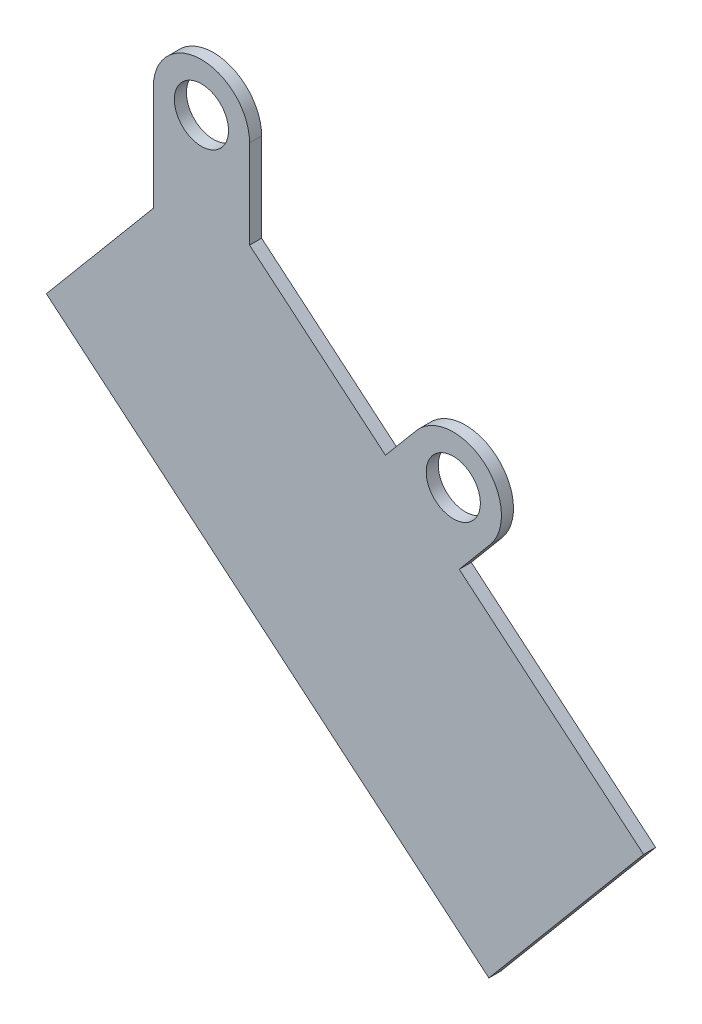
ISO-10303-21;
HEADER;
FILE_DESCRIPTION(('STEP AP214'),'2;1');
FILE_NAME('part.step','',(''),(''),'','','');
FILE_SCHEMA(('AUTOMOTIVE_DESIGN { 1 0 10303 214 1 1 1 1 }'));
ENDSEC;
DATA;
#1=APPLICATION_CONTEXT('core data for automotive mechanical design processes');
#2=APPLICATION_PROTOCOL_DEFINITION('international standard','automotive_design',2000,#1);
#3=PRODUCT_CONTEXT('',#1,'mechanical');
#4=PRODUCT('Part','Part','',(#3));
#5=PRODUCT_RELATED_PRODUCT_CATEGORY('part','',(#4));
#6=PRODUCT_DEFINITION_FORMATION('','',#4);
#7=PRODUCT_DEFINITION_CONTEXT('part definition',#1,'design');
#8=PRODUCT_DEFINITION('design','',#6,#7);
#9=PRODUCT_DEFINITION_SHAPE('','',#8);
#10=(LENGTH_UNIT() NAMED_UNIT(*) SI_UNIT(.MILLI.,.METRE.));
#11=(NAMED_UNIT(*) PLANE_ANGLE_UNIT() SI_UNIT($,.RADIAN.));
#12=(NAMED_UNIT(*) SI_UNIT($,.STERADIAN.) SOLID_ANGLE_UNIT());
#13=UNCERTAINTY_MEASURE_WITH_UNIT(LENGTH_MEASURE(1.E-05),#10,'distance_accuracy_value','');
#14=(GEOMETRIC_REPRESENTATION_CONTEXT(3) GLOBAL_UNCERTAINTY_ASSIGNED_CONTEXT((#13)) GLOBAL_UNIT_ASSIGNED_CONTEXT((#10,
#11,#12)) REPRESENTATION_CONTEXT('',''));
#15=CARTESIAN_POINT('',(0.,0.,0.));
#16=DIRECTION('',(0.,0.,1.));
#17=DIRECTION('',(1.,0.,0.));
#18=AXIS2_PLACEMENT_3D('',#15,#16,#17);
#19=CARTESIAN_POINT('',(158.284821825003,251.853740166621,3.175));
#20=DIRECTION('',(0.,0.,-1.));
#21=DIRECTION('',(-1.,0.,0.));
#22=AXIS2_PLACEMENT_3D('',#19,#20,#21);
#23=CYLINDRICAL_SURFACE('',#22,25.4);
#24=CARTESIAN_POINT('',(158.284821825003,251.853740166621,-3.175));
#25=DIRECTION('',(0.,0.,1.));
#26=DIRECTION('',(1.,0.,0.));
#27=AXIS2_PLACEMENT_3D('',#24,#25,#26);
#28=CIRCLE('',#27,25.4);
#29=CARTESIAN_POINT('',(138.827292969781,268.180545452659,-3.175));
#30=VERTEX_POINT('',#29);
#31=CARTESIAN_POINT('',(177.742350680225,235.526934880583,-3.175));
#32=VERTEX_POINT('',#31);
#33=EDGE_CURVE('E173',#30,#32,#28,.F.);
#34=ORIENTED_EDGE('',*,*,#33,.F.);
#35=DIRECTION('',(0.,0.,-1.));
#36=VECTOR('',#35,1.);
#37=CARTESIAN_POINT('',(138.827292969781,268.180545452659,3.175));
#38=LINE('',#37,#36);
#39=CARTESIAN_POINT('',(138.827292969781,268.180545452659,3.175));
#40=VERTEX_POINT('',#39);
#41=EDGE_CURVE('E11',#40,#30,#38,.T.);
#42=ORIENTED_EDGE('',*,*,#41,.F.);
#43=CARTESIAN_POINT('',(158.284821825003,251.853740166621,3.175));
#44=DIRECTION('',(0.,0.,1.));
#45=DIRECTION('',(1.,0.,0.));
#46=AXIS2_PLACEMENT_3D('',#43,#44,#45);
#47=CIRCLE('',#46,25.4);
#48=CARTESIAN_POINT('',(177.742350680225,235.526934880583,3.175));
#49=VERTEX_POINT('',#48);
#50=EDGE_CURVE('E217',#40,#49,#47,.F.);
#51=ORIENTED_EDGE('',*,*,#50,.T.);
#52=DIRECTION('',(0.,0.,-1.));
#53=VECTOR('',#52,1.);
#54=CARTESIAN_POINT('',(177.742350680225,235.526934880583,3.175));
#55=LINE('',#54,#53);
#56=EDGE_CURVE('E64',#49,#32,#55,.T.);
#57=ORIENTED_EDGE('',*,*,#56,.T.);
#58=EDGE_LOOP('',(#34,#42,#51,#57));
#59=FACE_BOUND('',#58,.T.);
#60=ADVANCED_FACE('F47',(#59),#23,.T.);
#61=CARTESIAN_POINT('',(-50.5859404822026,42.4466440013721,3.175));
#62=DIRECTION('',(0.766044443118977,-0.64278760968654,0.));
#63=DIRECTION('',(0.642787609686541,0.766044443118977,0.));
#64=AXIS2_PLACEMENT_3D('',#61,#62,#63);
#65=PLANE('',#64);
#66=DIRECTION('',(-0.642787609686541,-0.766044443118977,0.));
#67=VECTOR('',#66,1.);
#68=CARTESIAN_POINT('',(-50.5859404822026,42.4466440013721,-3.175));
#69=LINE('',#68,#67);
#70=CARTESIAN_POINT('',(122.500487683743,248.723016597437,-3.175));
#71=VERTEX_POINT('',#70);
#72=EDGE_CURVE('E176',#30,#71,#69,.T.);
#73=ORIENTED_EDGE('',*,*,#72,.T.);
#74=DIRECTION('',(0.,0.,-1.));
#75=VECTOR('',#74,1.);
#76=CARTESIAN_POINT('',(122.500487683743,248.723016597437,3.175));
#77=LINE('',#76,#75);
#78=CARTESIAN_POINT('',(122.500487683743,248.723016597437,3.175));
#79=VERTEX_POINT('',#78);
#80=EDGE_CURVE('E56',#79,#71,#77,.T.);
#81=ORIENTED_EDGE('',*,*,#80,.F.);
#82=DIRECTION('',(-0.642787609686541,-0.766044443118977,0.));
#83=VECTOR('',#82,1.);
#84=CARTESIAN_POINT('',(-50.5859404822026,42.4466440013721,3.175));
#85=LINE('',#84,#83);
#86=EDGE_CURVE('E271',#40,#79,#85,.T.);
#87=ORIENTED_EDGE('',*,*,#86,.F.);
#88=ORIENTED_EDGE('',*,*,#41,.T.);
#89=EDGE_LOOP('',(#73,#81,#87,#88));
#90=FACE_BOUND('',#89,.T.);
#91=ADVANCED_FACE('F305',(#90),#65,.F.);
#92=CARTESIAN_POINT('',(173.086428165946,206.276372596065,3.175));
#93=DIRECTION('',(-0.64278760968654,-0.766044443118977,0.));
#94=DIRECTION('',(0.766044443118978,-0.64278760968654,0.));
#95=AXIS2_PLACEMENT_3D('',#92,#93,#94);
#96=PLANE('',#95);
#97=DIRECTION('',(-0.766044443118977,0.64278760968654,0.));
#98=VECTOR('',#97,1.);
#99=CARTESIAN_POINT('',(173.086428165946,206.276372596065,-3.175));
#100=LINE('',#99,#98);
#101=CARTESIAN_POINT('',(50.8,308.886869368097,-3.175));
#102=VERTEX_POINT('',#101);
#103=EDGE_CURVE('E179',#71,#102,#100,.T.);
#104=ORIENTED_EDGE('',*,*,#103,.T.);
#105=DIRECTION('',(0.,0.,-1.));
#106=VECTOR('',#105,1.);
#107=CARTESIAN_POINT('',(50.8,308.886869368097,3.175));
#108=LINE('',#107,#106);
#109=CARTESIAN_POINT('',(50.8,308.886869368097,3.175));
#110=VERTEX_POINT('',#109);
#111=EDGE_CURVE('E238',#110,#102,#108,.T.);
#112=ORIENTED_EDGE('',*,*,#111,.F.);
#113=DIRECTION('',(-0.766044443118977,0.64278760968654,0.));
#114=VECTOR('',#113,1.);
#115=CARTESIAN_POINT('',(173.086428165946,206.276372596065,3.175));
#116=LINE('',#115,#114);
#117=EDGE_CURVE('E248',#79,#110,#116,.T.);
#118=ORIENTED_EDGE('',*,*,#117,.F.);
#119=ORIENTED_EDGE('',*,*,#80,.T.);
#120=EDGE_LOOP('',(#104,#112,#118,#119));
#121=FACE_BOUND('',#120,.T.);
#122=ADVANCED_FACE('F246',(#121),#96,.F.);
#123=CARTESIAN_POINT('',(50.8000000000001,0.,3.175));
#124=DIRECTION('',(1.,0.,0.));
#125=DIRECTION('',(0.,1.,0.));
#126=AXIS2_PLACEMENT_3D('',#123,#124,#125);
#127=PLANE('',#126);
#128=DIRECTION('',(0.,-1.,0.));
#129=VECTOR('',#128,1.);
#130=CARTESIAN_POINT('',(50.8000000000001,0.,-3.175));
#131=LINE('',#130,#129);
#132=CARTESIAN_POINT('',(50.8,355.6,-3.175));
#133=VERTEX_POINT('',#132);
#134=EDGE_CURVE('E183',#133,#102,#131,.T.);
#135=ORIENTED_EDGE('',*,*,#134,.F.);
#136=DIRECTION('',(0.,0.,-1.));
#137=VECTOR('',#136,1.);
#138=CARTESIAN_POINT('',(50.8,355.6,3.175));
#139=LINE('',#138,#137);
#140=CARTESIAN_POINT('',(50.8,355.6,3.175));
#141=VERTEX_POINT('',#140);
#142=EDGE_CURVE('E235',#141,#133,#139,.T.);
#143=ORIENTED_EDGE('',*,*,#142,.F.);
#144=DIRECTION('',(0.,-1.,0.));
#145=VECTOR('',#144,1.);
#146=CARTESIAN_POINT('',(50.8000000000001,0.,3.175));
#147=LINE('',#146,#145);
#148=EDGE_CURVE('E261',#141,#110,#147,.T.);
#149=ORIENTED_EDGE('',*,*,#148,.T.);
#150=ORIENTED_EDGE('',*,*,#111,.T.);
#151=EDGE_LOOP('',(#135,#143,#149,#150));
#152=FACE_BOUND('',#151,.T.);
#153=ADVANCED_FACE('F258',(#152),#127,.T.);
#154=CARTESIAN_POINT('',(25.3999999999999,355.6,3.175));
#155=DIRECTION('',(0.,0.,-1.));
#156=DIRECTION('',(-1.,0.,0.));
#157=AXIS2_PLACEMENT_3D('',#154,#155,#156);
#158=CYLINDRICAL_SURFACE('',#157,25.4);
#159=CARTESIAN_POINT('',(25.3999999999999,355.6,-3.175));
#160=DIRECTION('',(0.,0.,1.));
#161=DIRECTION('',(1.,0.,0.));
#162=AXIS2_PLACEMENT_3D('',#159,#160,#161);
#163=CIRCLE('',#162,25.4);
#164=CARTESIAN_POINT('',(0.,355.6,-3.175));
#165=VERTEX_POINT('',#164);
#166=EDGE_CURVE('E187',#165,#133,#163,.F.);
#167=ORIENTED_EDGE('',*,*,#166,.F.);
#168=DIRECTION('',(0.,0.,-1.));
#169=VECTOR('',#168,1.);
#170=CARTESIAN_POINT('',(0.,355.6,3.175));
#171=LINE('',#170,#169);
#172=CARTESIAN_POINT('',(0.,355.6,3.175));
#173=VERTEX_POINT('',#172);
#174=EDGE_CURVE('E232',#173,#165,#171,.T.);
#175=ORIENTED_EDGE('',*,*,#174,.F.);
#176=CARTESIAN_POINT('',(25.3999999999999,355.6,3.175));
#177=DIRECTION('',(0.,0.,1.));
#178=DIRECTION('',(1.,0.,0.));
#179=AXIS2_PLACEMENT_3D('',#176,#177,#178);
#180=CIRCLE('',#179,25.4);
#181=EDGE_CURVE('E265',#173,#141,#180,.F.);
#182=ORIENTED_EDGE('',*,*,#181,.T.);
#183=ORIENTED_EDGE('',*,*,#142,.T.);
#184=EDGE_LOOP('',(#167,#175,#182,#183));
#185=FACE_BOUND('',#184,.T.);
#186=ADVANCED_FACE('F316',(#185),#158,.T.);
#187=CARTESIAN_POINT('',(-2.18587590003146E-13,0.,3.175));
#188=DIRECTION('',(1.,0.,0.));
#189=DIRECTION('',(0.,1.,0.));
#190=AXIS2_PLACEMENT_3D('',#187,#188,#189);
#191=PLANE('',#190);
#192=DIRECTION('',(0.,-1.,0.));
#193=VECTOR('',#192,1.);
#194=CARTESIAN_POINT('',(-2.18587590003146E-13,0.,-3.175));
#195=LINE('',#194,#193);
#196=CARTESIAN_POINT('',(0.,300.309546317066,-3.175));
#197=VERTEX_POINT('',#196);
#198=EDGE_CURVE('E191',#165,#197,#195,.T.);
#199=ORIENTED_EDGE('',*,*,#198,.T.);
#200=DIRECTION('',(0.,0.,-1.));
#201=VECTOR('',#200,1.);
#202=CARTESIAN_POINT('',(0.,300.309546317066,3.175));
#203=LINE('',#202,#201);
#204=CARTESIAN_POINT('',(0.,300.309546317066,3.175));
#205=VERTEX_POINT('',#204);
#206=EDGE_CURVE('E228',#205,#197,#203,.T.);
#207=ORIENTED_EDGE('',*,*,#206,.F.);
#208=DIRECTION('',(0.,-1.,0.));
#209=VECTOR('',#208,1.);
#210=CARTESIAN_POINT('',(-2.18587590003146E-13,0.,3.175));
#211=LINE('',#210,#209);
#212=EDGE_CURVE('E269',#173,#205,#211,.T.);
#213=ORIENTED_EDGE('',*,*,#212,.F.);
#214=ORIENTED_EDGE('',*,*,#174,.T.);
#215=EDGE_LOOP('',(#199,#207,#213,#214));
#216=FACE_BOUND('',#215,.T.);
#217=ADVANCED_FACE('F319',(#216),#191,.F.);
#218=CARTESIAN_POINT('',(-147.873584758313,124.080670431563,3.175));
#219=DIRECTION('',(0.766044443118977,-0.64278760968654,0.));
#220=DIRECTION('',(0.64278760968654,0.766044443118977,0.));
#221=AXIS2_PLACEMENT_3D('',#218,#219,#220);
#222=PLANE('',#221);
#223=DIRECTION('',(-0.64278760968654,-0.766044443118977,0.));
#224=VECTOR('',#223,1.);
#225=CARTESIAN_POINT('',(-147.873584758313,124.080670431563,-3.175));
#226=LINE('',#225,#224);
#227=CARTESIAN_POINT('',(-56.4211830225575,233.069398751517,-3.175));
#228=VERTEX_POINT('',#227);
#229=EDGE_CURVE('E194',#197,#228,#226,.T.);
#230=ORIENTED_EDGE('',*,*,#229,.T.);
#231=DIRECTION('',(0.,0.,-1.));
#232=VECTOR('',#231,1.);
#233=CARTESIAN_POINT('',(-56.4211830225575,233.069398751517,3.175));
#234=LINE('',#233,#232);
#235=CARTESIAN_POINT('',(-56.4211830225575,233.069398751517,3.175));
#236=VERTEX_POINT('',#235);
#237=EDGE_CURVE('E224',#236,#228,#234,.T.);
#238=ORIENTED_EDGE('',*,*,#237,.F.);
#239=DIRECTION('',(-0.64278760968654,-0.766044443118977,0.));
#240=VECTOR('',#239,1.);
#241=CARTESIAN_POINT('',(-147.873584758313,124.080670431563,3.175));
#242=LINE('',#241,#240);
#243=EDGE_CURVE('E277',#205,#236,#242,.T.);
#244=ORIENTED_EDGE('',*,*,#243,.F.);
#245=ORIENTED_EDGE('',*,*,#206,.T.);
#246=EDGE_LOOP('',(#230,#238,#244,#245));
#247=FACE_BOUND('',#246,.T.);
#248=ADVANCED_FACE('F285',(#247),#222,.F.);
#249=CARTESIAN_POINT('',(91.452401735755,108.988728319955,3.175));
#250=DIRECTION('',(0.64278760968654,0.766044443118977,0.));
#251=DIRECTION('',(-0.766044443118977,0.64278760968654,0.));
#252=AXIS2_PLACEMENT_3D('',#249,#250,#251);
#253=PLANE('',#252);
#254=DIRECTION('',(0.766044443118977,-0.64278760968654,0.));
#255=VECTOR('',#254,1.);
#256=CARTESIAN_POINT('',(91.452401735755,108.988728319955,-3.175));
#257=LINE('',#256,#255);
#258=CARTESIAN_POINT('',(177.069163240107,37.1477353190599,-3.175));
#259=VERTEX_POINT('',#258);
#260=EDGE_CURVE('E197',#228,#259,#257,.T.);
#261=ORIENTED_EDGE('',*,*,#260,.T.);
#262=DIRECTION('',(0.,0.,-1.));
#263=VECTOR('',#262,1.);
#264=CARTESIAN_POINT('',(177.069163240107,37.1477353190599,3.175));
#265=LINE('',#264,#263);
#266=CARTESIAN_POINT('',(177.069163240107,37.1477353190599,3.175));
#267=VERTEX_POINT('',#266);
#268=EDGE_CURVE('E155',#267,#259,#265,.T.);
#269=ORIENTED_EDGE('',*,*,#268,.F.);
#270=DIRECTION('',(0.766044443118977,-0.64278760968654,0.));
#271=VECTOR('',#270,1.);
#272=CARTESIAN_POINT('',(91.452401735755,108.988728319955,3.175));
#273=LINE('',#272,#271);
#274=EDGE_CURVE('E141',#236,#267,#273,.T.);
#275=ORIENTED_EDGE('',*,*,#274,.F.);
#276=ORIENTED_EDGE('',*,*,#237,.T.);
#277=EDGE_LOOP('',(#261,#269,#275,#276));
#278=FACE_BOUND('',#277,.T.);
#279=ADVANCED_FACE('F289',(#278),#253,.F.);
#280=CARTESIAN_POINT('',(85.6167615043516,-71.8409930008948,3.175));
#281=DIRECTION('',(-0.766044443118977,0.64278760968654,0.));
#282=DIRECTION('',(-0.64278760968654,-0.766044443118977,0.));
#283=AXIS2_PLACEMENT_3D('',#280,#281,#282);
#284=PLANE('',#283);
#285=DIRECTION('',(0.64278760968654,0.766044443118977,0.));
#286=VECTOR('',#285,1.);
#287=CARTESIAN_POINT('',(85.6167615043516,-71.8409930008948,-3.175));
#288=LINE('',#287,#286);
#289=CARTESIAN_POINT('',(258.703189670297,134.43537959517,-3.175));
#290=VERTEX_POINT('',#289);
#291=EDGE_CURVE('E151',#259,#290,#288,.T.);
#292=ORIENTED_EDGE('',*,*,#291,.T.);
#293=DIRECTION('',(0.,0.,-1.));
#294=VECTOR('',#293,1.);
#295=CARTESIAN_POINT('',(258.703189670297,134.43537959517,3.175));
#296=LINE('',#295,#294);
#297=CARTESIAN_POINT('',(258.703189670297,134.43537959517,3.175));
#298=VERTEX_POINT('',#297);
#299=EDGE_CURVE('E148',#298,#290,#296,.T.);
#300=ORIENTED_EDGE('',*,*,#299,.F.);
#301=DIRECTION('',(0.64278760968654,0.766044443118977,0.));
#302=VECTOR('',#301,1.);
#303=CARTESIAN_POINT('',(85.6167615043516,-71.8409930008948,3.175));
#304=LINE('',#303,#302);
#305=EDGE_CURVE('E132',#267,#298,#304,.T.);
#306=ORIENTED_EDGE('',*,*,#305,.F.);
#307=ORIENTED_EDGE('',*,*,#268,.T.);
#308=EDGE_LOOP('',(#292,#300,#306,#307));
#309=FACE_BOUND('',#308,.T.);
#310=ADVANCED_FACE('F149',(#309),#284,.F.);
#311=CARTESIAN_POINT('',(173.086428165946,206.276372596065,3.175));
#312=DIRECTION('',(-0.64278760968654,-0.766044443118977,0.));
#313=DIRECTION('',(0.766044443118977,-0.64278760968654,0.));
#314=AXIS2_PLACEMENT_3D('',#311,#312,#313);
#315=PLANE('',#314);
#316=DIRECTION('',(-0.766044443118977,0.64278760968654,0.));
#317=VECTOR('',#316,1.);
#318=CARTESIAN_POINT('',(173.086428165946,206.276372596065,-3.175));
#319=LINE('',#318,#317);
#320=CARTESIAN_POINT('',(161.415545394187,216.069406025361,-3.175));
#321=VERTEX_POINT('',#320);
#322=EDGE_CURVE('E202',#290,#321,#319,.T.);
#323=ORIENTED_EDGE('',*,*,#322,.T.);
#324=DIRECTION('',(0.,0.,-1.));
#325=VECTOR('',#324,1.);
#326=CARTESIAN_POINT('',(161.415545394187,216.069406025361,3.175));
#327=LINE('',#326,#325);
#328=CARTESIAN_POINT('',(161.415545394187,216.069406025361,3.175));
#329=VERTEX_POINT('',#328);
#330=EDGE_CURVE('E99',#329,#321,#327,.T.);
#331=ORIENTED_EDGE('',*,*,#330,.F.);
#332=DIRECTION('',(-0.766044443118977,0.64278760968654,0.));
#333=VECTOR('',#332,1.);
#334=CARTESIAN_POINT('',(173.086428165946,206.276372596065,3.175));
#335=LINE('',#334,#333);
#336=EDGE_CURVE('E139',#298,#329,#335,.T.);
#337=ORIENTED_EDGE('',*,*,#336,.F.);
#338=ORIENTED_EDGE('',*,*,#299,.T.);
#339=EDGE_LOOP('',(#323,#331,#337,#338));
#340=FACE_BOUND('',#339,.T.);
#341=ADVANCED_FACE('F157',(#340),#315,.F.);
#342=CARTESIAN_POINT('',(158.284821825003,251.853740166621,3.175));
#343=DIRECTION('',(0.,0.,-1.));
#344=DIRECTION('',(-1.,0.,0.));
#345=AXIS2_PLACEMENT_3D('',#342,#343,#344);
#346=CYLINDRICAL_SURFACE('',#345,14.2875);
#347=CARTESIAN_POINT('',(158.284821825003,251.853740166621,3.175));
#348=DIRECTION('',(0.,0.,1.));
#349=DIRECTION('',(1.,0.,0.));
#350=AXIS2_PLACEMENT_3D('',#347,#348,#349);
#351=CIRCLE('',#350,14.2875);
#352=CARTESIAN_POINT('',(172.572321825003,251.853740166621,3.175));
#353=VERTEX_POINT('',#352);
#354=EDGE_CURVE('E162',#353,#353,#351,.T.);
#355=ORIENTED_EDGE('',*,*,#354,.T.);
#356=EDGE_LOOP('',(#355));
#357=FACE_BOUND('',#356,.T.);
#358=CARTESIAN_POINT('',(158.284821825003,251.853740166621,-3.175));
#359=DIRECTION('',(0.,0.,1.));
#360=DIRECTION('',(1.,0.,0.));
#361=AXIS2_PLACEMENT_3D('',#358,#359,#360);
#362=CIRCLE('',#361,14.2875);
#363=CARTESIAN_POINT('',(172.572321825003,251.853740166621,-3.175));
#364=VERTEX_POINT('',#363);
#365=EDGE_CURVE('E209',#364,#364,#362,.T.);
#366=ORIENTED_EDGE('',*,*,#365,.F.);
#367=EDGE_LOOP('',(#366));
#368=FACE_BOUND('',#367,.T.);
#369=ADVANCED_FACE('F293',(#357,#368),#346,.F.);
#370=CARTESIAN_POINT('',(-11.6708827717585,9.79303342929585,3.175));
#371=DIRECTION('',(0.766044443118977,-0.64278760968654,0.));
#372=DIRECTION('',(0.642787609686541,0.766044443118977,0.));
#373=AXIS2_PLACEMENT_3D('',#370,#371,#372);
#374=PLANE('',#373);
#375=DIRECTION('',(-0.642787609686541,-0.766044443118977,0.));
#376=VECTOR('',#375,1.);
#377=CARTESIAN_POINT('',(-11.6708827717585,9.79303342929585,-3.175));
#378=LINE('',#377,#376);
#379=EDGE_CURVE('E205',#32,#321,#378,.T.);
#380=ORIENTED_EDGE('',*,*,#379,.F.);
#381=ORIENTED_EDGE('',*,*,#56,.F.);
#382=DIRECTION('',(-0.642787609686541,-0.766044443118977,0.));
#383=VECTOR('',#382,1.);
#384=CARTESIAN_POINT('',(-11.6708827717585,9.79303342929585,3.175));
#385=LINE('',#384,#383);
#386=EDGE_CURVE('E159',#49,#329,#385,.T.);
#387=ORIENTED_EDGE('',*,*,#386,.T.);
#388=ORIENTED_EDGE('',*,*,#330,.T.);
#389=EDGE_LOOP('',(#380,#381,#387,#388));
#390=FACE_BOUND('',#389,.T.);
#391=ADVANCED_FACE('F290',(#390),#374,.T.);
#392=CARTESIAN_POINT('',(25.3999999999999,355.6,3.175));
#393=DIRECTION('',(0.,0.,-1.));
#394=DIRECTION('',(-1.,0.,0.));
#395=AXIS2_PLACEMENT_3D('',#392,#393,#394);
#396=CYLINDRICAL_SURFACE('',#395,14.2875);
#397=CARTESIAN_POINT('',(25.3999999999999,355.6,3.175));
#398=DIRECTION('',(0.,0.,1.));
#399=DIRECTION('',(1.,0.,0.));
#400=AXIS2_PLACEMENT_3D('',#397,#398,#399);
#401=CIRCLE('',#400,14.2875);
#402=CARTESIAN_POINT('',(39.6874999999999,355.6,3.175));
#403=VERTEX_POINT('',#402);
#404=EDGE_CURVE('E169',#403,#403,#401,.T.);
#405=ORIENTED_EDGE('',*,*,#404,.T.);
#406=EDGE_LOOP('',(#405));
#407=FACE_BOUND('',#406,.T.);
#408=CARTESIAN_POINT('',(25.3999999999999,355.6,-3.175));
#409=DIRECTION('',(0.,0.,1.));
#410=DIRECTION('',(1.,0.,0.));
#411=AXIS2_PLACEMENT_3D('',#408,#409,#410);
#412=CIRCLE('',#411,14.2875);
#413=CARTESIAN_POINT('',(39.6874999999999,355.6,-3.175));
#414=VERTEX_POINT('',#413);
#415=EDGE_CURVE('E213',#414,#414,#412,.T.);
#416=ORIENTED_EDGE('',*,*,#415,.F.);
#417=EDGE_LOOP('',(#416));
#418=FACE_BOUND('',#417,.T.);
#419=ADVANCED_FACE('F292',(#407,#418),#396,.F.);
#420=CARTESIAN_POINT('',(0.,0.,3.175));
#421=DIRECTION('',(0.,0.,1.));
#422=DIRECTION('',(1.,0.,0.));
#423=AXIS2_PLACEMENT_3D('',#420,#421,#422);
#424=PLANE('',#423);
#425=ORIENTED_EDGE('',*,*,#50,.F.);
#426=ORIENTED_EDGE('',*,*,#86,.T.);
#427=ORIENTED_EDGE('',*,*,#117,.T.);
#428=ORIENTED_EDGE('',*,*,#148,.F.);
#429=ORIENTED_EDGE('',*,*,#181,.F.);
#430=ORIENTED_EDGE('',*,*,#212,.T.);
#431=ORIENTED_EDGE('',*,*,#243,.T.);
#432=ORIENTED_EDGE('',*,*,#274,.T.);
#433=ORIENTED_EDGE('',*,*,#305,.T.);
#434=ORIENTED_EDGE('',*,*,#336,.T.);
#435=ORIENTED_EDGE('',*,*,#386,.F.);
#436=EDGE_LOOP('',(#425,#426,#427,#428,#429,#430,#431,#432,#433,#434,#435));
#437=FACE_BOUND('',#436,.T.);
#438=ORIENTED_EDGE('',*,*,#354,.F.);
#439=EDGE_LOOP('',(#438));
#440=FACE_BOUND('',#439,.T.);
#441=ORIENTED_EDGE('',*,*,#404,.F.);
#442=EDGE_LOOP('',(#441));
#443=FACE_BOUND('',#442,.T.);
#444=ADVANCED_FACE('F135',(#437,#440,#443),#424,.T.);
#445=CARTESIAN_POINT('',(0.,0.,-3.175));
#446=DIRECTION('',(0.,0.,1.));
#447=DIRECTION('',(1.,0.,0.));
#448=AXIS2_PLACEMENT_3D('',#445,#446,#447);
#449=PLANE('',#448);
#450=ORIENTED_EDGE('',*,*,#33,.T.);
#451=ORIENTED_EDGE('',*,*,#379,.T.);
#452=ORIENTED_EDGE('',*,*,#322,.F.);
#453=ORIENTED_EDGE('',*,*,#291,.F.);
#454=ORIENTED_EDGE('',*,*,#260,.F.);
#455=ORIENTED_EDGE('',*,*,#229,.F.);
#456=ORIENTED_EDGE('',*,*,#198,.F.);
#457=ORIENTED_EDGE('',*,*,#166,.T.);
#458=ORIENTED_EDGE('',*,*,#134,.T.);
#459=ORIENTED_EDGE('',*,*,#103,.F.);
#460=ORIENTED_EDGE('',*,*,#72,.F.);
#461=EDGE_LOOP('',(#450,#451,#452,#453,#454,#455,#456,#457,#458,#459,#460));
#462=FACE_BOUND('',#461,.T.);
#463=ORIENTED_EDGE('',*,*,#365,.T.);
#464=EDGE_LOOP('',(#463));
#465=FACE_BOUND('',#464,.T.);
#466=ORIENTED_EDGE('',*,*,#415,.T.);
#467=EDGE_LOOP('',(#466));
#468=FACE_BOUND('',#467,.T.);
#469=ADVANCED_FACE('F252',(#462,#465,#468),#449,.F.);
#470=CLOSED_SHELL('',(#60,#91,#122,#153,#186,#217,#248,#279,#310,#341,#369,#391,#419,#444,#469));
#471=MANIFOLD_SOLID_BREP('B2',#470);
#472=ADVANCED_BREP_SHAPE_REPRESENTATION('',(#18,#471),#14);
#473=SHAPE_DEFINITION_REPRESENTATION(#9,#472);
ENDSEC;
END-ISO-10303-21;
